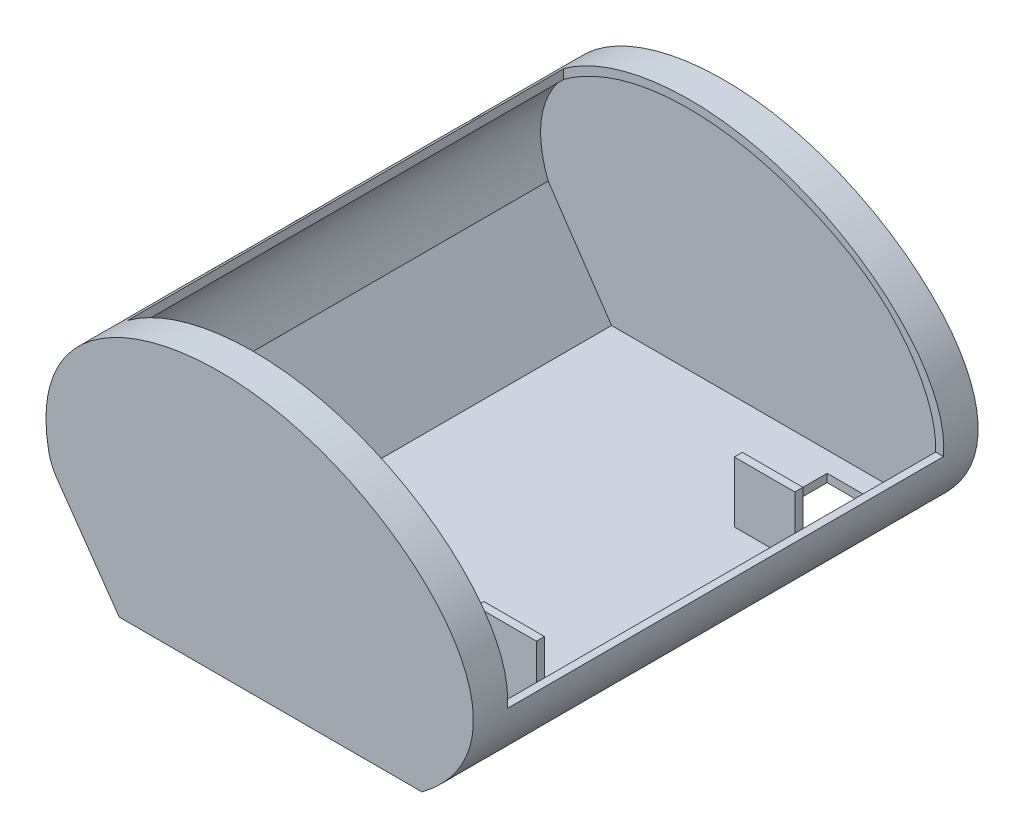
ISO-10303-21;
HEADER;
FILE_DESCRIPTION(('STEP AP214'),'2;1');
FILE_NAME('part.step','',(''),(''),'','','');
FILE_SCHEMA(('AUTOMOTIVE_DESIGN { 1 0 10303 214 1 1 1 1 }'));
ENDSEC;
DATA;
#1=APPLICATION_CONTEXT('core data for automotive mechanical design processes');
#2=APPLICATION_PROTOCOL_DEFINITION('international standard','automotive_design',2000,#1);
#3=PRODUCT_CONTEXT('',#1,'mechanical');
#4=PRODUCT('Part','Part','',(#3));
#5=PRODUCT_RELATED_PRODUCT_CATEGORY('part','',(#4));
#6=PRODUCT_DEFINITION_FORMATION('','',#4);
#7=PRODUCT_DEFINITION_CONTEXT('part definition',#1,'design');
#8=PRODUCT_DEFINITION('design','',#6,#7);
#9=PRODUCT_DEFINITION_SHAPE('','',#8);
#10=(LENGTH_UNIT() NAMED_UNIT(*) SI_UNIT(.MILLI.,.METRE.));
#11=(NAMED_UNIT(*) PLANE_ANGLE_UNIT() SI_UNIT($,.RADIAN.));
#12=(NAMED_UNIT(*) SI_UNIT($,.STERADIAN.) SOLID_ANGLE_UNIT());
#13=UNCERTAINTY_MEASURE_WITH_UNIT(LENGTH_MEASURE(1.E-05),#10,'distance_accuracy_value','');
#14=(GEOMETRIC_REPRESENTATION_CONTEXT(3) GLOBAL_UNCERTAINTY_ASSIGNED_CONTEXT((#13)) GLOBAL_UNIT_ASSIGNED_CONTEXT((#10,
#11,#12)) REPRESENTATION_CONTEXT('',''));
#15=CARTESIAN_POINT('',(0.,0.,0.));
#16=DIRECTION('',(0.,0.,1.));
#17=DIRECTION('',(1.,0.,0.));
#18=AXIS2_PLACEMENT_3D('',#15,#16,#17);
#19=CARTESIAN_POINT('',(-73.6035136631855,4.,6.99999999999998));
#20=DIRECTION('',(0.,-1.,0.));
#21=DIRECTION('',(0.,0.,-1.));
#22=AXIS2_PLACEMENT_3D('',#19,#20,#21);
#23=PLANE('',#22);
#24=DIRECTION('',(0.,0.,1.));
#25=VECTOR('',#24,1.);
#26=CARTESIAN_POINT('',(43.1633759469,4.,59.));
#27=LINE('',#26,#25);
#28=CARTESIAN_POINT('',(43.1633759469,4.,59.));
#29=VERTEX_POINT('',#28);
#30=CARTESIAN_POINT('',(43.1633759469,4.,63.));
#31=VERTEX_POINT('',#30);
#32=EDGE_CURVE('E263',#29,#31,#27,.T.);
#33=ORIENTED_EDGE('',*,*,#32,.F.);
#34=DIRECTION('',(0.,0.,-1.));
#35=VECTOR('',#34,1.);
#36=CARTESIAN_POINT('',(43.1633759469,4.,6.99999999999998));
#37=LINE('',#36,#35);
#38=CARTESIAN_POINT('',(43.1633759469,4.,17.));
#39=VERTEX_POINT('',#38);
#40=EDGE_CURVE('E245',#29,#39,#37,.T.);
#41=ORIENTED_EDGE('',*,*,#40,.T.);
#42=DIRECTION('',(1.,0.,0.));
#43=VECTOR('',#42,1.);
#44=CARTESIAN_POINT('',(-73.6035136631855,4.,17.));
#45=LINE('',#44,#43);
#46=CARTESIAN_POINT('',(73.1633759469,3.99999999999999,17.));
#47=VERTEX_POINT('',#46);
#48=EDGE_CURVE('E248',#39,#47,#45,.T.);
#49=ORIENTED_EDGE('',*,*,#48,.T.);
#50=DIRECTION('',(0.,0.,1.));
#51=VECTOR('',#50,1.);
#52=CARTESIAN_POINT('',(73.1633759469,4.,6.99999999999998));
#53=LINE('',#52,#51);
#54=CARTESIAN_POINT('',(73.1633759469,4.,6.99999999999998));
#55=VERTEX_POINT('',#54);
#56=EDGE_CURVE('E422',#55,#47,#53,.T.);
#57=ORIENTED_EDGE('',*,*,#56,.F.);
#58=DIRECTION('',(1.,0.,0.));
#59=VECTOR('',#58,1.);
#60=CARTESIAN_POINT('',(-73.6035136631855,4.,6.99999999999998));
#61=LINE('',#60,#59);
#62=CARTESIAN_POINT('',(-73.6035136631855,4.,6.99999999999998));
#63=VERTEX_POINT('',#62);
#64=EDGE_CURVE('E479',#63,#55,#61,.T.);
#65=ORIENTED_EDGE('',*,*,#64,.F.);
#66=DIRECTION('',(0.,0.,1.));
#67=VECTOR('',#66,1.);
#68=CARTESIAN_POINT('',(-73.6035136631855,4.,6.99999999999998));
#69=LINE('',#68,#67);
#70=CARTESIAN_POINT('',(-73.6035136631855,4.,243.));
#71=VERTEX_POINT('',#70);
#72=EDGE_CURVE('E481',#63,#71,#69,.T.);
#73=ORIENTED_EDGE('',*,*,#72,.T.);
#74=DIRECTION('',(1.,0.,0.));
#75=VECTOR('',#74,1.);
#76=CARTESIAN_POINT('',(-73.6035136631855,4.,243.));
#77=LINE('',#76,#75);
#78=CARTESIAN_POINT('',(73.1633759469,4.,243.));
#79=VERTEX_POINT('',#78);
#80=EDGE_CURVE('E367',#71,#79,#77,.T.);
#81=ORIENTED_EDGE('',*,*,#80,.T.);
#82=CARTESIAN_POINT('',(73.1633759469,4.,233.));
#83=VERTEX_POINT('',#82);
#84=EDGE_CURVE('E483',#83,#79,#53,.T.);
#85=ORIENTED_EDGE('',*,*,#84,.F.);
#86=DIRECTION('',(-1.,0.,0.));
#87=VECTOR('',#86,1.);
#88=CARTESIAN_POINT('',(-73.6035136631855,4.,233.));
#89=LINE('',#88,#87);
#90=CARTESIAN_POINT('',(43.1633759469,4.,233.));
#91=VERTEX_POINT('',#90);
#92=EDGE_CURVE('E299',#83,#91,#89,.T.);
#93=ORIENTED_EDGE('',*,*,#92,.T.);
#94=DIRECTION('',(0.,0.,-1.));
#95=VECTOR('',#94,1.);
#96=CARTESIAN_POINT('',(43.1633759469,4.,6.99999999999998));
#97=LINE('',#96,#95);
#98=CARTESIAN_POINT('',(43.1633759469,4.,191.));
#99=VERTEX_POINT('',#98);
#100=EDGE_CURVE('E290',#91,#99,#97,.T.);
#101=ORIENTED_EDGE('',*,*,#100,.T.);
#102=DIRECTION('',(0.,0.,1.));
#103=VECTOR('',#102,1.);
#104=CARTESIAN_POINT('',(43.1633759469,4.,187.));
#105=LINE('',#104,#103);
#106=CARTESIAN_POINT('',(43.1633759469,4.,187.));
#107=VERTEX_POINT('',#106);
#108=EDGE_CURVE('E307',#107,#99,#105,.T.);
#109=ORIENTED_EDGE('',*,*,#108,.F.);
#110=DIRECTION('',(-1.,0.,0.));
#111=VECTOR('',#110,1.);
#112=CARTESIAN_POINT('',(73.1633759469,4.,187.));
#113=LINE('',#112,#111);
#114=CARTESIAN_POINT('',(73.1633759469,4.,187.));
#115=VERTEX_POINT('',#114);
#116=EDGE_CURVE('E316',#115,#107,#113,.T.);
#117=ORIENTED_EDGE('',*,*,#116,.F.);
#118=CARTESIAN_POINT('',(73.1633759469,4.,63.));
#119=VERTEX_POINT('',#118);
#120=EDGE_CURVE('E486',#119,#115,#53,.T.);
#121=ORIENTED_EDGE('',*,*,#120,.F.);
#122=DIRECTION('',(1.,0.,0.));
#123=VECTOR('',#122,1.);
#124=CARTESIAN_POINT('',(43.1633759469,4.,63.));
#125=LINE('',#124,#123);
#126=EDGE_CURVE('E256',#31,#119,#125,.T.);
#127=ORIENTED_EDGE('',*,*,#126,.F.);
#128=EDGE_LOOP('',(#33,#41,#49,#57,#65,#73,#81,#85,#93,#101,#109,#117,#121,#127));
#129=FACE_BOUND('',#128,.T.);
#130=ADVANCED_FACE('F36',(#129),#23,.F.);
#131=CARTESIAN_POINT('',(75.533147288239,0.,250.));
#132=CARTESIAN_POINT('',(138.063372933709,47.200510512775,250.));
#133=CARTESIAN_POINT('',(16.4700015421519,172.007803307629,250.));
#134=CARTESIAN_POINT('',(-124.949591117591,111.301552399339,250.));
#135=CARTESIAN_POINT('',(-108.081203547603,48.0359610796154,250.));
#136=B_SPLINE_CURVE_WITH_KNOTS('',3,(#131,#132,#133,#134,#135),.UNSPECIFIED.,.F.,.F.,(4,1,4),
(0.,0.526874502564795,1.),.UNSPECIFIED.);
#137=DIRECTION('',(0.,0.,-1.));
#138=VECTOR('',#137,1.);
#139=SURFACE_OF_LINEAR_EXTRUSION('',#136,#138);
#140=CARTESIAN_POINT('',(75.533147288239,0.,0.));
#141=CARTESIAN_POINT('',(138.063372933709,47.200510512775,0.));
#142=CARTESIAN_POINT('',(16.4700015421519,172.007803307629,0.));
#143=CARTESIAN_POINT('',(-124.949591117591,111.301552399339,0.));
#144=CARTESIAN_POINT('',(-108.081203547603,48.0359610796154,0.));
#145=B_SPLINE_CURVE_WITH_KNOTS('',3,(#140,#141,#142,#143,#144),.UNSPECIFIED.,.F.,.F.,(4,1,4),
(0.,0.526874502564795,1.),.UNSPECIFIED.);
#146=CARTESIAN_POINT('',(75.533147288239,0.,0.));
#147=VERTEX_POINT('',#146);
#148=CARTESIAN_POINT('',(-109.377947898669,53.6487675030821,0.));
#149=VERTEX_POINT('',#148);
#150=EDGE_CURVE('E424',#147,#149,#145,.T.);
#151=ORIENTED_EDGE('',*,*,#150,.T.);
#152=DIRECTION('',(0.,0.,-1.));
#153=VECTOR('',#152,1.);
#154=CARTESIAN_POINT('',(-109.377947898669,53.6487675030821,0.));
#155=LINE('',#154,#153);
#156=CARTESIAN_POINT('',(-109.377947898669,53.6487675030821,250.));
#157=VERTEX_POINT('',#156);
#158=EDGE_CURVE('E44',#149,#157,#155,.F.);
#159=ORIENTED_EDGE('',*,*,#158,.T.);
#160=CARTESIAN_POINT('',(75.533147288239,0.,250.));
#161=VERTEX_POINT('',#160);
#162=EDGE_CURVE('E406',#161,#157,#136,.T.);
#163=ORIENTED_EDGE('',*,*,#162,.F.);
#164=DIRECTION('',(0.,0.,-1.));
#165=VECTOR('',#164,1.);
#166=CARTESIAN_POINT('',(75.533147288239,0.,250.));
#167=LINE('',#166,#165);
#168=EDGE_CURVE('E413',#161,#147,#167,.T.);
#169=ORIENTED_EDGE('',*,*,#168,.T.);
#170=EDGE_LOOP('',(#151,#159,#163,#169));
#171=FACE_BOUND('',#170,.T.);
#172=CARTESIAN_POINT('',(75.533147288239,0.,17.));
#173=CARTESIAN_POINT('',(138.063372933709,47.200510512775,17.));
#174=CARTESIAN_POINT('',(16.4700015421519,172.007803307629,17.));
#175=CARTESIAN_POINT('',(-124.949591117591,111.301552399339,17.));
#176=CARTESIAN_POINT('',(-108.081203547603,48.0359610796154,17.));
#177=B_SPLINE_CURVE_WITH_KNOTS('',3,(#172,#173,#174,#175,#176),.UNSPECIFIED.,.F.,.F.,(4,1,4),
(0.,0.526874502564795,1.),.UNSPECIFIED.);
#178=CARTESIAN_POINT('',(100.817760707179,40.,17.));
#179=VERTEX_POINT('',#178);
#180=CARTESIAN_POINT('',(-87.2929632459917,112.348527909877,17.));
#181=VERTEX_POINT('',#180);
#182=EDGE_CURVE('E355',#179,#181,#177,.T.);
#183=ORIENTED_EDGE('',*,*,#182,.F.);
#184=DIRECTION('',(0.,0.,-1.));
#185=VECTOR('',#184,1.);
#186=CARTESIAN_POINT('',(100.817760707179,40.,250.));
#187=LINE('',#186,#185);
#188=CARTESIAN_POINT('',(100.817760707179,40.,233.));
#189=VERTEX_POINT('',#188);
#190=EDGE_CURVE('E344',#189,#179,#187,.T.);
#191=ORIENTED_EDGE('',*,*,#190,.F.);
#192=CARTESIAN_POINT('',(75.533147288239,0.,233.));
#193=CARTESIAN_POINT('',(138.063372933709,47.200510512775,233.));
#194=CARTESIAN_POINT('',(16.4700015421519,172.007803307629,233.));
#195=CARTESIAN_POINT('',(-124.949591117591,111.301552399339,233.));
#196=CARTESIAN_POINT('',(-108.081203547603,48.0359610796154,233.));
#197=B_SPLINE_CURVE_WITH_KNOTS('',3,(#192,#193,#194,#195,#196),.UNSPECIFIED.,.F.,.F.,(4,1,4),
(0.,0.526874502564795,1.),.UNSPECIFIED.);
#198=CARTESIAN_POINT('',(-87.2929632459916,112.348527917054,233.));
#199=VERTEX_POINT('',#198);
#200=EDGE_CURVE('E346',#199,#189,#197,.F.);
#201=ORIENTED_EDGE('',*,*,#200,.F.);
#202=DIRECTION('',(0.,0.,-1.));
#203=VECTOR('',#202,1.);
#204=CARTESIAN_POINT('',(-87.2929632459916,112.348527909877,250.));
#205=LINE('',#204,#203);
#206=EDGE_CURVE('E350',#181,#199,#205,.F.);
#207=ORIENTED_EDGE('',*,*,#206,.F.);
#208=EDGE_LOOP('',(#183,#191,#201,#207));
#209=FACE_BOUND('',#208,.T.);
#210=ADVANCED_FACE('F400',(#171,#209),#139,.F.);
#211=CARTESIAN_POINT('',(-108.081203547603,48.0359610796154,250.));
#212=DIRECTION('',(0.819318627790458,0.573338456895716,0.));
#213=DIRECTION('',(-0.573338456895716,0.819318627790458,0.));
#214=AXIS2_PLACEMENT_3D('',#211,#212,#213);
#215=PLANE('',#214);
#216=DIRECTION('',(0.573338456895716,-0.819318627790458,0.));
#217=VECTOR('',#216,1.);
#218=CARTESIAN_POINT('',(-108.081203547603,48.0359610796154,250.));
#219=LINE('',#218,#217);
#220=CARTESIAN_POINT('',(-105.3215590263,44.09234254995,250.));
#221=VERTEX_POINT('',#220);
#222=CARTESIAN_POINT('',(-74.466852711761,0.,250.));
#223=VERTEX_POINT('',#222);
#224=EDGE_CURVE('E429',#221,#223,#219,.T.);
#225=ORIENTED_EDGE('',*,*,#224,.F.);
#226=DIRECTION('',(0.,0.,-1.));
#227=VECTOR('',#226,1.);
#228=CARTESIAN_POINT('',(-105.3215590263,44.09234254995,250.));
#229=LINE('',#228,#227);
#230=CARTESIAN_POINT('',(-105.3215590263,44.09234254995,0.));
#231=VERTEX_POINT('',#230);
#232=EDGE_CURVE('E453',#221,#231,#229,.T.);
#233=ORIENTED_EDGE('',*,*,#232,.T.);
#234=DIRECTION('',(0.573338456895716,-0.819318627790458,0.));
#235=VECTOR('',#234,1.);
#236=CARTESIAN_POINT('',(-108.081203547603,48.0359610796154,0.));
#237=LINE('',#236,#235);
#238=CARTESIAN_POINT('',(-74.466852711761,0.,0.));
#239=VERTEX_POINT('',#238);
#240=EDGE_CURVE('E416',#231,#239,#237,.T.);
#241=ORIENTED_EDGE('',*,*,#240,.T.);
#242=DIRECTION('',(0.,0.,-1.));
#243=VECTOR('',#242,1.);
#244=CARTESIAN_POINT('',(-74.466852711761,0.,250.));
#245=LINE('',#244,#243);
#246=EDGE_CURVE('E435',#223,#239,#245,.T.);
#247=ORIENTED_EDGE('',*,*,#246,.F.);
#248=EDGE_LOOP('',(#225,#233,#241,#247));
#249=FACE_BOUND('',#248,.T.);
#250=ADVANCED_FACE('F404',(#249),#215,.F.);
#251=CARTESIAN_POINT('',(-74.466852711761,0.,250.));
#252=DIRECTION('',(0.,1.,0.));
#253=DIRECTION('',(0.,0.,1.));
#254=AXIS2_PLACEMENT_3D('',#251,#252,#253);
#255=PLANE('',#254);
#256=DIRECTION('',(0.,0.,1.));
#257=VECTOR('',#256,1.);
#258=CARTESIAN_POINT('',(43.1633759469,0.,59.));
#259=LINE('',#258,#257);
#260=CARTESIAN_POINT('',(43.1633759469,0.,17.));
#261=VERTEX_POINT('',#260);
#262=CARTESIAN_POINT('',(43.1633759469,0.,59.));
#263=VERTEX_POINT('',#262);
#264=EDGE_CURVE('E223',#261,#263,#259,.T.);
#265=ORIENTED_EDGE('',*,*,#264,.T.);
#266=DIRECTION('',(1.,0.,0.));
#267=VECTOR('',#266,1.);
#268=CARTESIAN_POINT('',(73.1633759469,0.,59.));
#269=LINE('',#268,#267);
#270=CARTESIAN_POINT('',(73.1633759469,0.,59.));
#271=VERTEX_POINT('',#270);
#272=EDGE_CURVE('E216',#263,#271,#269,.T.);
#273=ORIENTED_EDGE('',*,*,#272,.T.);
#274=DIRECTION('',(0.,0.,-1.));
#275=VECTOR('',#274,1.);
#276=CARTESIAN_POINT('',(73.1633759469,0.,17.));
#277=LINE('',#276,#275);
#278=CARTESIAN_POINT('',(73.1633759469,0.,17.));
#279=VERTEX_POINT('',#278);
#280=EDGE_CURVE('E226',#271,#279,#277,.T.);
#281=ORIENTED_EDGE('',*,*,#280,.T.);
#282=DIRECTION('',(-1.,0.,0.));
#283=VECTOR('',#282,1.);
#284=CARTESIAN_POINT('',(43.1633759469,0.,17.));
#285=LINE('',#284,#283);
#286=EDGE_CURVE('E51',#279,#261,#285,.T.);
#287=ORIENTED_EDGE('',*,*,#286,.T.);
#288=EDGE_LOOP('',(#265,#273,#281,#287));
#289=FACE_BOUND('',#288,.T.);
#290=DIRECTION('',(0.,0.,-1.));
#291=VECTOR('',#290,1.);
#292=CARTESIAN_POINT('',(73.1633759469,0.,191.));
#293=LINE('',#292,#291);
#294=CARTESIAN_POINT('',(73.1633759469,0.,233.));
#295=VERTEX_POINT('',#294);
#296=CARTESIAN_POINT('',(73.1633759469,0.,191.));
#297=VERTEX_POINT('',#296);
#298=EDGE_CURVE('E283',#295,#297,#293,.T.);
#299=ORIENTED_EDGE('',*,*,#298,.T.);
#300=DIRECTION('',(-1.,0.,0.));
#301=VECTOR('',#300,1.);
#302=CARTESIAN_POINT('',(43.1633759469,0.,191.));
#303=LINE('',#302,#301);
#304=CARTESIAN_POINT('',(43.1633759469,0.,191.));
#305=VERTEX_POINT('',#304);
#306=EDGE_CURVE('E274',#297,#305,#303,.T.);
#307=ORIENTED_EDGE('',*,*,#306,.T.);
#308=DIRECTION('',(0.,0.,1.));
#309=VECTOR('',#308,1.);
#310=CARTESIAN_POINT('',(43.1633759469,0.,233.));
#311=LINE('',#310,#309);
#312=CARTESIAN_POINT('',(43.1633759469,0.,233.));
#313=VERTEX_POINT('',#312);
#314=EDGE_CURVE('E277',#305,#313,#311,.T.);
#315=ORIENTED_EDGE('',*,*,#314,.T.);
#316=DIRECTION('',(1.,0.,0.));
#317=VECTOR('',#316,1.);
#318=CARTESIAN_POINT('',(73.1633759469,0.,233.));
#319=LINE('',#318,#317);
#320=EDGE_CURVE('E280',#313,#295,#319,.T.);
#321=ORIENTED_EDGE('',*,*,#320,.T.);
#322=EDGE_LOOP('',(#299,#307,#315,#321));
#323=FACE_BOUND('',#322,.T.);
#324=DIRECTION('',(1.,0.,0.));
#325=VECTOR('',#324,1.);
#326=CARTESIAN_POINT('',(-74.466852711761,0.,0.));
#327=LINE('',#326,#325);
#328=EDGE_CURVE('E421',#239,#147,#327,.T.);
#329=ORIENTED_EDGE('',*,*,#328,.T.);
#330=ORIENTED_EDGE('',*,*,#168,.F.);
#331=DIRECTION('',(1.,0.,0.));
#332=VECTOR('',#331,1.);
#333=CARTESIAN_POINT('',(-74.466852711761,0.,250.));
#334=LINE('',#333,#332);
#335=EDGE_CURVE('E414',#223,#161,#334,.T.);
#336=ORIENTED_EDGE('',*,*,#335,.F.);
#337=ORIENTED_EDGE('',*,*,#246,.T.);
#338=EDGE_LOOP('',(#329,#330,#336,#337));
#339=FACE_BOUND('',#338,.T.);
#340=ADVANCED_FACE('F230',(#289,#323,#339),#255,.F.);
#341=CARTESIAN_POINT('',(15.0172284058632,124.643387424618,250.));
#342=DIRECTION('',(0.,0.,-1.));
#343=DIRECTION('',(-1.,0.,0.));
#344=AXIS2_PLACEMENT_3D('',#341,#342,#343);
#345=PLANE('',#344);
#346=ORIENTED_EDGE('',*,*,#162,.T.);
#347=CARTESIAN_POINT('',(-84.8385933315385,58.4258039723429,250.));
#348=DIRECTION('',(0.,0.,-1.));
#349=DIRECTION('',(-1.,0.,0.));
#350=AXIS2_PLACEMENT_3D('',#347,#348,#349);
#351=CIRCLE('',#350,25.);
#352=EDGE_CURVE('E11',#157,#221,#351,.F.);
#353=ORIENTED_EDGE('',*,*,#352,.T.);
#354=ORIENTED_EDGE('',*,*,#224,.T.);
#355=ORIENTED_EDGE('',*,*,#335,.T.);
#356=EDGE_LOOP('',(#346,#353,#354,#355));
#357=FACE_BOUND('',#356,.T.);
#358=ADVANCED_FACE('F391',(#357),#345,.F.);
#359=CARTESIAN_POINT('',(15.0172284058632,124.643387424618,0.));
#360=DIRECTION('',(0.,0.,-1.));
#361=DIRECTION('',(-1.,0.,0.));
#362=AXIS2_PLACEMENT_3D('',#359,#360,#361);
#363=PLANE('',#362);
#364=ORIENTED_EDGE('',*,*,#240,.F.);
#365=CARTESIAN_POINT('',(-84.8385933315385,58.4258039723429,0.));
#366=DIRECTION('',(0.,0.,-1.));
#367=DIRECTION('',(-1.,0.,0.));
#368=AXIS2_PLACEMENT_3D('',#365,#366,#367);
#369=CIRCLE('',#368,25.);
#370=EDGE_CURVE('E459',#231,#149,#369,.T.);
#371=ORIENTED_EDGE('',*,*,#370,.T.);
#372=ORIENTED_EDGE('',*,*,#150,.F.);
#373=ORIENTED_EDGE('',*,*,#328,.F.);
#374=EDGE_LOOP('',(#364,#371,#372,#373));
#375=FACE_BOUND('',#374,.T.);
#376=ADVANCED_FACE('F394',(#375),#363,.T.);
#377=CARTESIAN_POINT('',(100.952032286488,276.,17.));
#378=DIRECTION('',(0.,0.,1.));
#379=DIRECTION('',(1.,0.,0.));
#380=AXIS2_PLACEMENT_3D('',#377,#378,#379);
#381=PLANE('',#380);
#382=ORIENTED_EDGE('',*,*,#182,.T.);
#383=DIRECTION('',(0.,-1.,0.));
#384=VECTOR('',#383,1.);
#385=CARTESIAN_POINT('',(-87.2929632459917,276.,17.));
#386=LINE('',#385,#384);
#387=CARTESIAN_POINT('',(-87.2929632459917,107.728967573858,17.));
#388=VERTEX_POINT('',#387);
#389=EDGE_CURVE('E341',#181,#388,#386,.T.);
#390=ORIENTED_EDGE('',*,*,#389,.T.);
#391=CARTESIAN_POINT('',(80.7933445131643,10.7283548595188,17.));
#392=CARTESIAN_POINT('',(92.6518174180523,19.5638089018508,17.));
#393=CARTESIAN_POINT('',(103.009839438884,45.2055581146663,17.));
#394=CARTESIAN_POINT('',(79.9540275925971,88.9181032500631,17.));
#395=CARTESIAN_POINT('',(40.6078998734824,112.956105179898,17.));
#396=CARTESIAN_POINT('',(-11.2047524715402,129.142722191542,17.));
#397=CARTESIAN_POINT('',(-79.4316828248308,124.667635826406,17.));
#398=CARTESIAN_POINT('',(-117.344714605008,82.323825457182,17.));
#399=CARTESIAN_POINT('',(-105.002588912021,50.2782470025866,17.));
#400=B_SPLINE_CURVE_WITH_KNOTS('',3,(#391,#392,#393,#394,#395,#396,#397,#398,#399),
.UNSPECIFIED.,.F.,.F.,(4,1,1,1,1,1,4),(0.0162788731190725,0.12675304049054,0.268313114127122,
0.41474667415268,0.542882575717674,0.761532881303762,1.),.UNSPECIFIED.);
#401=CARTESIAN_POINT('',(96.9220854235917,40.,17.));
#402=VERTEX_POINT('',#401);
#403=EDGE_CURVE('E449',#388,#402,#400,.F.);
#404=ORIENTED_EDGE('',*,*,#403,.T.);
#405=DIRECTION('',(-1.,0.,0.));
#406=VECTOR('',#405,1.);
#407=CARTESIAN_POINT('',(100.952032286488,40.,17.));
#408=LINE('',#407,#406);
#409=EDGE_CURVE('E332',#179,#402,#408,.T.);
#410=ORIENTED_EDGE('',*,*,#409,.F.);
#411=EDGE_LOOP('',(#382,#390,#404,#410));
#412=FACE_BOUND('',#411,.T.);
#413=ADVANCED_FACE('F398',(#412),#381,.T.);
#414=CARTESIAN_POINT('',(-87.2929632459917,276.,17.));
#415=DIRECTION('',(1.,0.,0.));
#416=DIRECTION('',(0.,0.,-1.));
#417=AXIS2_PLACEMENT_3D('',#414,#415,#416);
#418=PLANE('',#417);
#419=ORIENTED_EDGE('',*,*,#206,.T.);
#420=DIRECTION('',(0.,-1.,0.));
#421=VECTOR('',#420,1.);
#422=CARTESIAN_POINT('',(-87.2929632459916,276.,233.));
#423=LINE('',#422,#421);
#424=CARTESIAN_POINT('',(-87.2929632459916,107.728967581088,233.));
#425=VERTEX_POINT('',#424);
#426=EDGE_CURVE('E338',#199,#425,#423,.T.);
#427=ORIENTED_EDGE('',*,*,#426,.T.);
#428=DIRECTION('',(0.,0.,1.));
#429=VECTOR('',#428,1.);
#430=CARTESIAN_POINT('',(-87.2929632459917,107.728967573857,6.99999999999998));
#431=LINE('',#430,#429);
#432=EDGE_CURVE('E444',#425,#388,#431,.F.);
#433=ORIENTED_EDGE('',*,*,#432,.T.);
#434=ORIENTED_EDGE('',*,*,#389,.F.);
#435=EDGE_LOOP('',(#419,#427,#433,#434));
#436=FACE_BOUND('',#435,.T.);
#437=ADVANCED_FACE('F575',(#436),#418,.T.);
#438=CARTESIAN_POINT('',(-87.2929632459916,276.,233.));
#439=DIRECTION('',(0.,0.,-1.));
#440=DIRECTION('',(-1.,0.,0.));
#441=AXIS2_PLACEMENT_3D('',#438,#439,#440);
#442=PLANE('',#441);
#443=ORIENTED_EDGE('',*,*,#200,.T.);
#444=DIRECTION('',(1.,0.,0.));
#445=VECTOR('',#444,1.);
#446=CARTESIAN_POINT('',(-87.2929632459916,40.,233.));
#447=LINE('',#446,#445);
#448=CARTESIAN_POINT('',(96.9220854235917,40.,233.));
#449=VERTEX_POINT('',#448);
#450=EDGE_CURVE('E335',#449,#189,#447,.T.);
#451=ORIENTED_EDGE('',*,*,#450,.F.);
#452=CARTESIAN_POINT('',(80.7933445131643,10.7283548595188,233.));
#453=CARTESIAN_POINT('',(92.6518174180523,19.5638089018508,233.));
#454=CARTESIAN_POINT('',(103.009839438884,45.2055581146663,233.));
#455=CARTESIAN_POINT('',(79.9540275925971,88.9181032500631,233.));
#456=CARTESIAN_POINT('',(40.6078998734824,112.956105179898,233.));
#457=CARTESIAN_POINT('',(-11.2047524715402,129.142722191542,233.));
#458=CARTESIAN_POINT('',(-79.4316828248308,124.667635826406,233.));
#459=CARTESIAN_POINT('',(-117.344714605008,82.323825457182,233.));
#460=CARTESIAN_POINT('',(-105.002588912021,50.2782470025866,233.));
#461=B_SPLINE_CURVE_WITH_KNOTS('',3,(#452,#453,#454,#455,#456,#457,#458,#459,#460),
.UNSPECIFIED.,.F.,.F.,(4,1,1,1,1,1,4),(0.0162788731190725,0.12675304049054,0.268313114127122,
0.41474667415268,0.542882575717674,0.761532881303762,1.),.UNSPECIFIED.);
#462=EDGE_CURVE('E440',#449,#425,#461,.T.);
#463=ORIENTED_EDGE('',*,*,#462,.T.);
#464=ORIENTED_EDGE('',*,*,#426,.F.);
#465=EDGE_LOOP('',(#443,#451,#463,#464));
#466=FACE_BOUND('',#465,.T.);
#467=ADVANCED_FACE('F579',(#466),#442,.T.);
#468=CARTESIAN_POINT('',(0.,40.,0.));
#469=DIRECTION('',(0.,1.,0.));
#470=DIRECTION('',(0.,0.,1.));
#471=AXIS2_PLACEMENT_3D('',#468,#469,#470);
#472=PLANE('',#471);
#473=ORIENTED_EDGE('',*,*,#190,.T.);
#474=ORIENTED_EDGE('',*,*,#409,.T.);
#475=DIRECTION('',(0.,0.,1.));
#476=VECTOR('',#475,1.);
#477=CARTESIAN_POINT('',(96.9220854235917,40.,6.99999999999998));
#478=LINE('',#477,#476);
#479=EDGE_CURVE('E438',#402,#449,#478,.T.);
#480=ORIENTED_EDGE('',*,*,#479,.T.);
#481=ORIENTED_EDGE('',*,*,#450,.T.);
#482=EDGE_LOOP('',(#473,#474,#480,#481));
#483=FACE_BOUND('',#482,.T.);
#484=ADVANCED_FACE('F384',(#483),#472,.T.);
#485=CARTESIAN_POINT('',(80.7933445131643,10.7283548595188,6.99999999999998));
#486=CARTESIAN_POINT('',(92.6518174180523,19.5638089018508,6.99999999999998));
#487=CARTESIAN_POINT('',(103.009839438884,45.2055581146663,6.99999999999998));
#488=CARTESIAN_POINT('',(79.9540275925971,88.9181032500631,6.99999999999998));
#489=CARTESIAN_POINT('',(40.6078998734824,112.956105179898,6.99999999999998));
#490=CARTESIAN_POINT('',(-11.2047524715402,129.142722191542,6.99999999999998));
#491=CARTESIAN_POINT('',(-79.4316828248308,124.667635826406,6.99999999999998));
#492=CARTESIAN_POINT('',(-117.344714605008,82.323825457182,6.99999999999998));
#493=CARTESIAN_POINT('',(-105.002588912021,50.2782470025866,6.99999999999998));
#494=B_SPLINE_CURVE_WITH_KNOTS('',3,(#485,#486,#487,#488,#489,#490,#491,#492,#493),
.UNSPECIFIED.,.F.,.F.,(4,1,1,1,1,1,4),(0.0162788731190725,0.12675304049054,0.268313114127122,
0.41474667415268,0.542882575717674,0.761532881303762,1.),.UNSPECIFIED.);
#495=DIRECTION('',(0.,0.,1.));
#496=VECTOR('',#495,1.);
#497=SURFACE_OF_LINEAR_EXTRUSION('',#494,#496);
#498=CARTESIAN_POINT('',(80.7933445131643,10.7283548595188,243.));
#499=CARTESIAN_POINT('',(92.6518174180523,19.5638089018508,243.));
#500=CARTESIAN_POINT('',(103.009839438884,45.2055581146663,243.));
#501=CARTESIAN_POINT('',(79.9540275925971,88.9181032500631,243.));
#502=CARTESIAN_POINT('',(40.6078998734824,112.956105179898,243.));
#503=CARTESIAN_POINT('',(-11.2047524715402,129.142722191542,243.));
#504=CARTESIAN_POINT('',(-79.4316828248308,124.667635826406,243.));
#505=CARTESIAN_POINT('',(-117.344714605008,82.323825457182,243.));
#506=CARTESIAN_POINT('',(-105.002588912021,50.2782470025866,243.));
#507=B_SPLINE_CURVE_WITH_KNOTS('',3,(#498,#499,#500,#501,#502,#503,#504,#505,#506),
.UNSPECIFIED.,.F.,.F.,(4,1,1,1,1,1,4),(0.0162788731190725,0.12675304049054,0.268313114127122,
0.41474667415268,0.542882575717674,0.761532881303762,1.),.UNSPECIFIED.);
#508=CARTESIAN_POINT('',(80.7933445131643,10.7283548595188,243.));
#509=VERTEX_POINT('',#508);
#510=CARTESIAN_POINT('',(-105.002588912021,50.2782470025866,243.));
#511=VERTEX_POINT('',#510);
#512=EDGE_CURVE('E493',#509,#511,#507,.T.);
#513=ORIENTED_EDGE('',*,*,#512,.T.);
#514=DIRECTION('',(0.,0.,1.));
#515=VECTOR('',#514,1.);
#516=CARTESIAN_POINT('',(-105.002588912021,50.2782470025866,6.99999999999998));
#517=LINE('',#516,#515);
#518=CARTESIAN_POINT('',(-105.002588912021,50.2782470025866,6.99999999999998));
#519=VERTEX_POINT('',#518);
#520=EDGE_CURVE('E478',#519,#511,#517,.T.);
#521=ORIENTED_EDGE('',*,*,#520,.F.);
#522=CARTESIAN_POINT('',(80.7933445131643,10.7283548595188,6.99999999999998));
#523=VERTEX_POINT('',#522);
#524=EDGE_CURVE('E366',#523,#519,#494,.T.);
#525=ORIENTED_EDGE('',*,*,#524,.F.);
#526=DIRECTION('',(0.,0.,1.));
#527=VECTOR('',#526,1.);
#528=CARTESIAN_POINT('',(80.7933445131643,10.7283548595188,6.99999999999998));
#529=LINE('',#528,#527);
#530=EDGE_CURVE('E476',#523,#509,#529,.T.);
#531=ORIENTED_EDGE('',*,*,#530,.T.);
#532=EDGE_LOOP('',(#513,#521,#525,#531));
#533=FACE_BOUND('',#532,.T.);
#534=ORIENTED_EDGE('',*,*,#403,.F.);
#535=ORIENTED_EDGE('',*,*,#432,.F.);
#536=ORIENTED_EDGE('',*,*,#462,.F.);
#537=ORIENTED_EDGE('',*,*,#479,.F.);
#538=EDGE_LOOP('',(#534,#535,#536,#537));
#539=FACE_BOUND('',#538,.T.);
#540=ADVANCED_FACE('F379',(#533,#539),#497,.F.);
#541=CARTESIAN_POINT('',(73.1633759469,4.,6.99999999999998));
#542=DIRECTION('',(0.661402166727986,-0.750031448572341,0.));
#543=DIRECTION('',(0.750031448572341,0.661402166727987,0.));
#544=AXIS2_PLACEMENT_3D('',#541,#542,#543);
#545=PLANE('',#544);
#546=DIRECTION('',(0.750031448572341,0.661402166727987,0.));
#547=VECTOR('',#546,1.);
#548=CARTESIAN_POINT('',(73.1633759469,4.,243.));
#549=LINE('',#548,#547);
#550=EDGE_CURVE('E359',#79,#509,#549,.T.);
#551=ORIENTED_EDGE('',*,*,#550,.T.);
#552=ORIENTED_EDGE('',*,*,#530,.F.);
#553=DIRECTION('',(0.750031448572341,0.661402166727987,0.));
#554=VECTOR('',#553,1.);
#555=CARTESIAN_POINT('',(73.1633759469,4.,6.99999999999998));
#556=LINE('',#555,#554);
#557=EDGE_CURVE('E360',#55,#523,#556,.T.);
#558=ORIENTED_EDGE('',*,*,#557,.F.);
#559=ORIENTED_EDGE('',*,*,#56,.T.);
#560=DIRECTION('',(0.,0.,1.));
#561=VECTOR('',#560,1.);
#562=CARTESIAN_POINT('',(73.1633759469,4.,6.99999999999998));
#563=LINE('',#562,#561);
#564=CARTESIAN_POINT('',(73.1633759469,4.,59.));
#565=VERTEX_POINT('',#564);
#566=EDGE_CURVE('E239',#47,#565,#563,.T.);
#567=ORIENTED_EDGE('',*,*,#566,.T.);
#568=DIRECTION('',(0.,0.,-1.));
#569=VECTOR('',#568,1.);
#570=CARTESIAN_POINT('',(73.1633759469,4.,63.));
#571=LINE('',#570,#569);
#572=EDGE_CURVE('E251',#119,#565,#571,.T.);
#573=ORIENTED_EDGE('',*,*,#572,.F.);
#574=ORIENTED_EDGE('',*,*,#120,.T.);
#575=DIRECTION('',(0.,0.,-1.));
#576=VECTOR('',#575,1.);
#577=CARTESIAN_POINT('',(73.1633759469,4.,191.));
#578=LINE('',#577,#576);
#579=CARTESIAN_POINT('',(73.1633759469,4.,191.));
#580=VERTEX_POINT('',#579);
#581=EDGE_CURVE('E302',#580,#115,#578,.T.);
#582=ORIENTED_EDGE('',*,*,#581,.F.);
#583=EDGE_CURVE('E487',#580,#83,#53,.T.);
#584=ORIENTED_EDGE('',*,*,#583,.T.);
#585=ORIENTED_EDGE('',*,*,#84,.T.);
#586=EDGE_LOOP('',(#551,#552,#558,#559,#567,#573,#574,#582,#584,#585));
#587=FACE_BOUND('',#586,.T.);
#588=ADVANCED_FACE('F383',(#587),#545,.F.);
#589=CARTESIAN_POINT('',(-105.002588912021,50.2782470025866,6.99999999999998));
#590=DIRECTION('',(-0.827509179255177,-0.561452186965571,0.));
#591=DIRECTION('',(0.561452186965571,-0.827509179255178,0.));
#592=AXIS2_PLACEMENT_3D('',#589,#590,#591);
#593=PLANE('',#592);
#594=DIRECTION('',(0.561452186965571,-0.827509179255177,0.));
#595=VECTOR('',#594,1.);
#596=CARTESIAN_POINT('',(-105.002588912021,50.2782470025866,243.));
#597=LINE('',#596,#595);
#598=EDGE_CURVE('E490',#511,#71,#597,.T.);
#599=ORIENTED_EDGE('',*,*,#598,.T.);
#600=ORIENTED_EDGE('',*,*,#72,.F.);
#601=DIRECTION('',(0.561452186965571,-0.827509179255177,0.));
#602=VECTOR('',#601,1.);
#603=CARTESIAN_POINT('',(-105.002588912021,50.2782470025866,6.99999999999998));
#604=LINE('',#603,#602);
#605=EDGE_CURVE('E373',#519,#63,#604,.T.);
#606=ORIENTED_EDGE('',*,*,#605,.F.);
#607=ORIENTED_EDGE('',*,*,#520,.T.);
#608=EDGE_LOOP('',(#599,#600,#606,#607));
#609=FACE_BOUND('',#608,.T.);
#610=ADVANCED_FACE('F386',(#609),#593,.F.);
#611=CARTESIAN_POINT('',(9.02922967914925,121.980036436193,6.99999999999998));
#612=DIRECTION('',(0.,0.,-1.));
#613=DIRECTION('',(-1.,0.,0.));
#614=AXIS2_PLACEMENT_3D('',#611,#612,#613);
#615=PLANE('',#614);
#616=ORIENTED_EDGE('',*,*,#557,.T.);
#617=ORIENTED_EDGE('',*,*,#524,.T.);
#618=ORIENTED_EDGE('',*,*,#605,.T.);
#619=ORIENTED_EDGE('',*,*,#64,.T.);
#620=EDGE_LOOP('',(#616,#617,#618,#619));
#621=FACE_BOUND('',#620,.T.);
#622=ADVANCED_FACE('F507',(#621),#615,.F.);
#623=CARTESIAN_POINT('',(9.02922967914925,121.980036436193,243.));
#624=DIRECTION('',(0.,0.,-1.));
#625=DIRECTION('',(-1.,0.,0.));
#626=AXIS2_PLACEMENT_3D('',#623,#624,#625);
#627=PLANE('',#626);
#628=ORIENTED_EDGE('',*,*,#550,.F.);
#629=ORIENTED_EDGE('',*,*,#80,.F.);
#630=ORIENTED_EDGE('',*,*,#598,.F.);
#631=ORIENTED_EDGE('',*,*,#512,.F.);
#632=EDGE_LOOP('',(#628,#629,#630,#631));
#633=FACE_BOUND('',#632,.T.);
#634=ADVANCED_FACE('F519',(#633),#627,.T.);
#635=CARTESIAN_POINT('',(-84.8385933315385,58.4258039723429,125.));
#636=DIRECTION('',(0.,0.,-1.));
#637=DIRECTION('',(-1.,0.,0.));
#638=AXIS2_PLACEMENT_3D('',#635,#636,#637);
#639=CYLINDRICAL_SURFACE('',#638,25.);
#640=ORIENTED_EDGE('',*,*,#352,.F.);
#641=ORIENTED_EDGE('',*,*,#158,.F.);
#642=ORIENTED_EDGE('',*,*,#370,.F.);
#643=ORIENTED_EDGE('',*,*,#232,.F.);
#644=EDGE_LOOP('',(#640,#641,#642,#643));
#645=FACE_BOUND('',#644,.T.);
#646=ADVANCED_FACE('F38',(#645),#639,.T.);
#647=CARTESIAN_POINT('',(73.1633759469,34.,191.));
#648=DIRECTION('',(-1.,0.,0.));
#649=DIRECTION('',(0.,0.,1.));
#650=AXIS2_PLACEMENT_3D('',#647,#648,#649);
#651=PLANE('',#650);
#652=ORIENTED_EDGE('',*,*,#581,.T.);
#653=DIRECTION('',(0.,-1.,0.));
#654=VECTOR('',#653,1.);
#655=CARTESIAN_POINT('',(73.1633759469,34.,187.));
#656=LINE('',#655,#654);
#657=CARTESIAN_POINT('',(73.1633759469,34.,187.));
#658=VERTEX_POINT('',#657);
#659=EDGE_CURVE('E329',#658,#115,#656,.T.);
#660=ORIENTED_EDGE('',*,*,#659,.F.);
#661=DIRECTION('',(0.,0.,-1.));
#662=VECTOR('',#661,1.);
#663=CARTESIAN_POINT('',(73.1633759469,34.,191.));
#664=LINE('',#663,#662);
#665=CARTESIAN_POINT('',(73.1633759469,34.,191.));
#666=VERTEX_POINT('',#665);
#667=EDGE_CURVE('E303',#666,#658,#664,.T.);
#668=ORIENTED_EDGE('',*,*,#667,.F.);
#669=DIRECTION('',(0.,-1.,0.));
#670=VECTOR('',#669,1.);
#671=CARTESIAN_POINT('',(73.1633759469,34.,191.));
#672=LINE('',#671,#670);
#673=EDGE_CURVE('E313',#666,#580,#672,.T.);
#674=ORIENTED_EDGE('',*,*,#673,.T.);
#675=EDGE_LOOP('',(#652,#660,#668,#674));
#676=FACE_BOUND('',#675,.T.);
#677=ADVANCED_FACE('F535',(#676),#651,.F.);
#678=CARTESIAN_POINT('',(73.1633759469,34.,187.));
#679=DIRECTION('',(0.,0.,1.));
#680=DIRECTION('',(1.,0.,0.));
#681=AXIS2_PLACEMENT_3D('',#678,#679,#680);
#682=PLANE('',#681);
#683=ORIENTED_EDGE('',*,*,#116,.T.);
#684=DIRECTION('',(0.,-1.,0.));
#685=VECTOR('',#684,1.);
#686=CARTESIAN_POINT('',(43.1633759469,34.,187.));
#687=LINE('',#686,#685);
#688=CARTESIAN_POINT('',(43.1633759469,34.,187.));
#689=VERTEX_POINT('',#688);
#690=EDGE_CURVE('E326',#689,#107,#687,.T.);
#691=ORIENTED_EDGE('',*,*,#690,.F.);
#692=DIRECTION('',(-1.,0.,0.));
#693=VECTOR('',#692,1.);
#694=CARTESIAN_POINT('',(73.1633759469,34.,187.));
#695=LINE('',#694,#693);
#696=EDGE_CURVE('E306',#658,#689,#695,.T.);
#697=ORIENTED_EDGE('',*,*,#696,.F.);
#698=ORIENTED_EDGE('',*,*,#659,.T.);
#699=EDGE_LOOP('',(#683,#691,#697,#698));
#700=FACE_BOUND('',#699,.T.);
#701=ADVANCED_FACE('F532',(#700),#682,.F.);
#702=CARTESIAN_POINT('',(43.1633759469,34.,187.));
#703=DIRECTION('',(1.,0.,0.));
#704=DIRECTION('',(0.,0.,-1.));
#705=AXIS2_PLACEMENT_3D('',#702,#703,#704);
#706=PLANE('',#705);
#707=ORIENTED_EDGE('',*,*,#108,.T.);
#708=DIRECTION('',(0.,-1.,0.));
#709=VECTOR('',#708,1.);
#710=CARTESIAN_POINT('',(43.1633759469,34.,191.));
#711=LINE('',#710,#709);
#712=CARTESIAN_POINT('',(43.1633759469,34.,191.));
#713=VERTEX_POINT('',#712);
#714=EDGE_CURVE('E323',#713,#99,#711,.T.);
#715=ORIENTED_EDGE('',*,*,#714,.F.);
#716=DIRECTION('',(0.,0.,1.));
#717=VECTOR('',#716,1.);
#718=CARTESIAN_POINT('',(43.1633759469,34.,187.));
#719=LINE('',#718,#717);
#720=EDGE_CURVE('E309',#689,#713,#719,.T.);
#721=ORIENTED_EDGE('',*,*,#720,.F.);
#722=ORIENTED_EDGE('',*,*,#690,.T.);
#723=EDGE_LOOP('',(#707,#715,#721,#722));
#724=FACE_BOUND('',#723,.T.);
#725=ADVANCED_FACE('F551',(#724),#706,.F.);
#726=CARTESIAN_POINT('',(43.1633759469,34.,191.));
#727=DIRECTION('',(0.,0.,-1.));
#728=DIRECTION('',(-1.,0.,0.));
#729=AXIS2_PLACEMENT_3D('',#726,#727,#728);
#730=PLANE('',#729);
#731=ORIENTED_EDGE('',*,*,#714,.T.);
#732=DIRECTION('',(0.,1.,0.));
#733=VECTOR('',#732,1.);
#734=CARTESIAN_POINT('',(43.1633759469,0.,191.));
#735=LINE('',#734,#733);
#736=EDGE_CURVE('E286',#305,#99,#735,.T.);
#737=ORIENTED_EDGE('',*,*,#736,.F.);
#738=ORIENTED_EDGE('',*,*,#306,.F.);
#739=DIRECTION('',(0.,1.,0.));
#740=VECTOR('',#739,1.);
#741=CARTESIAN_POINT('',(73.1633759469,0.,191.));
#742=LINE('',#741,#740);
#743=EDGE_CURVE('E287',#297,#580,#742,.T.);
#744=ORIENTED_EDGE('',*,*,#743,.T.);
#745=ORIENTED_EDGE('',*,*,#673,.F.);
#746=DIRECTION('',(1.,0.,0.));
#747=VECTOR('',#746,1.);
#748=CARTESIAN_POINT('',(43.1633759469,34.,191.));
#749=LINE('',#748,#747);
#750=EDGE_CURVE('E311',#713,#666,#749,.T.);
#751=ORIENTED_EDGE('',*,*,#750,.F.);
#752=EDGE_LOOP('',(#731,#737,#738,#744,#745,#751));
#753=FACE_BOUND('',#752,.T.);
#754=ADVANCED_FACE('F539',(#753),#730,.F.);
#755=CARTESIAN_POINT('',(0.,34.,0.));
#756=DIRECTION('',(0.,1.,0.));
#757=DIRECTION('',(0.,0.,1.));
#758=AXIS2_PLACEMENT_3D('',#755,#756,#757);
#759=PLANE('',#758);
#760=ORIENTED_EDGE('',*,*,#667,.T.);
#761=ORIENTED_EDGE('',*,*,#696,.T.);
#762=ORIENTED_EDGE('',*,*,#720,.T.);
#763=ORIENTED_EDGE('',*,*,#750,.T.);
#764=EDGE_LOOP('',(#760,#761,#762,#763));
#765=FACE_BOUND('',#764,.T.);
#766=ADVANCED_FACE('F554',(#765),#759,.T.);
#767=CARTESIAN_POINT('',(73.1633759469,0.,233.));
#768=DIRECTION('',(0.,0.,1.));
#769=DIRECTION('',(1.,0.,0.));
#770=AXIS2_PLACEMENT_3D('',#767,#768,#769);
#771=PLANE('',#770);
#772=DIRECTION('',(0.,1.,0.));
#773=VECTOR('',#772,1.);
#774=CARTESIAN_POINT('',(73.1633759469,0.,233.));
#775=LINE('',#774,#773);
#776=EDGE_CURVE('E291',#295,#83,#775,.T.);
#777=ORIENTED_EDGE('',*,*,#776,.F.);
#778=ORIENTED_EDGE('',*,*,#320,.F.);
#779=DIRECTION('',(0.,1.,0.));
#780=VECTOR('',#779,1.);
#781=CARTESIAN_POINT('',(43.1633759469,0.,233.));
#782=LINE('',#781,#780);
#783=EDGE_CURVE('E293',#313,#91,#782,.T.);
#784=ORIENTED_EDGE('',*,*,#783,.T.);
#785=ORIENTED_EDGE('',*,*,#92,.F.);
#786=EDGE_LOOP('',(#777,#778,#784,#785));
#787=FACE_BOUND('',#786,.T.);
#788=ADVANCED_FACE('F546',(#787),#771,.F.);
#789=CARTESIAN_POINT('',(73.1633759469,0.,191.));
#790=DIRECTION('',(1.,0.,0.));
#791=DIRECTION('',(0.,0.,-1.));
#792=AXIS2_PLACEMENT_3D('',#789,#790,#791);
#793=PLANE('',#792);
#794=ORIENTED_EDGE('',*,*,#743,.F.);
#795=ORIENTED_EDGE('',*,*,#298,.F.);
#796=ORIENTED_EDGE('',*,*,#776,.T.);
#797=ORIENTED_EDGE('',*,*,#583,.F.);
#798=EDGE_LOOP('',(#794,#795,#796,#797));
#799=FACE_BOUND('',#798,.T.);
#800=ADVANCED_FACE('F542',(#799),#793,.F.);
#801=CARTESIAN_POINT('',(43.1633759469,0.,233.));
#802=DIRECTION('',(-1.,0.,0.));
#803=DIRECTION('',(0.,0.,1.));
#804=AXIS2_PLACEMENT_3D('',#801,#802,#803);
#805=PLANE('',#804);
#806=ORIENTED_EDGE('',*,*,#783,.F.);
#807=ORIENTED_EDGE('',*,*,#314,.F.);
#808=ORIENTED_EDGE('',*,*,#736,.T.);
#809=ORIENTED_EDGE('',*,*,#100,.F.);
#810=EDGE_LOOP('',(#806,#807,#808,#809));
#811=FACE_BOUND('',#810,.T.);
#812=ADVANCED_FACE('F548',(#811),#805,.F.);
#813=CARTESIAN_POINT('',(73.1633759469,34.,63.));
#814=DIRECTION('',(-1.,0.,0.));
#815=DIRECTION('',(0.,0.,1.));
#816=AXIS2_PLACEMENT_3D('',#813,#814,#815);
#817=PLANE('',#816);
#818=ORIENTED_EDGE('',*,*,#572,.T.);
#819=DIRECTION('',(0.,-1.,0.));
#820=VECTOR('',#819,1.);
#821=CARTESIAN_POINT('',(73.1633759469,34.,59.));
#822=LINE('',#821,#820);
#823=CARTESIAN_POINT('',(73.1633759469,34.,59.));
#824=VERTEX_POINT('',#823);
#825=EDGE_CURVE('E219',#824,#565,#822,.T.);
#826=ORIENTED_EDGE('',*,*,#825,.F.);
#827=DIRECTION('',(0.,0.,-1.));
#828=VECTOR('',#827,1.);
#829=CARTESIAN_POINT('',(73.1633759469,34.,63.));
#830=LINE('',#829,#828);
#831=CARTESIAN_POINT('',(73.1633759469,34.,63.));
#832=VERTEX_POINT('',#831);
#833=EDGE_CURVE('E252',#832,#824,#830,.T.);
#834=ORIENTED_EDGE('',*,*,#833,.F.);
#835=DIRECTION('',(0.,-1.,0.));
#836=VECTOR('',#835,1.);
#837=CARTESIAN_POINT('',(73.1633759469,34.,63.));
#838=LINE('',#837,#836);
#839=EDGE_CURVE('E59',#832,#119,#838,.T.);
#840=ORIENTED_EDGE('',*,*,#839,.T.);
#841=EDGE_LOOP('',(#818,#826,#834,#840));
#842=FACE_BOUND('',#841,.T.);
#843=ADVANCED_FACE('F626',(#842),#817,.F.);
#844=CARTESIAN_POINT('',(73.1633759469,34.,59.));
#845=DIRECTION('',(0.,0.,1.));
#846=DIRECTION('',(1.,0.,0.));
#847=AXIS2_PLACEMENT_3D('',#844,#845,#846);
#848=PLANE('',#847);
#849=ORIENTED_EDGE('',*,*,#825,.T.);
#850=DIRECTION('',(0.,1.,0.));
#851=VECTOR('',#850,1.);
#852=CARTESIAN_POINT('',(73.1633759469,0.,59.));
#853=LINE('',#852,#851);
#854=EDGE_CURVE('E211',#271,#565,#853,.T.);
#855=ORIENTED_EDGE('',*,*,#854,.F.);
#856=ORIENTED_EDGE('',*,*,#272,.F.);
#857=DIRECTION('',(0.,1.,0.));
#858=VECTOR('',#857,1.);
#859=CARTESIAN_POINT('',(43.1633759469,0.,59.));
#860=LINE('',#859,#858);
#861=EDGE_CURVE('E237',#263,#29,#860,.T.);
#862=ORIENTED_EDGE('',*,*,#861,.T.);
#863=DIRECTION('',(0.,-1.,0.));
#864=VECTOR('',#863,1.);
#865=CARTESIAN_POINT('',(43.1633759469,34.,59.));
#866=LINE('',#865,#864);
#867=CARTESIAN_POINT('',(43.1633759469,34.,59.));
#868=VERTEX_POINT('',#867);
#869=EDGE_CURVE('E270',#868,#29,#866,.T.);
#870=ORIENTED_EDGE('',*,*,#869,.F.);
#871=DIRECTION('',(-1.,0.,0.));
#872=VECTOR('',#871,1.);
#873=CARTESIAN_POINT('',(73.1633759469,34.,59.));
#874=LINE('',#873,#872);
#875=EDGE_CURVE('E255',#824,#868,#874,.T.);
#876=ORIENTED_EDGE('',*,*,#875,.F.);
#877=EDGE_LOOP('',(#849,#855,#856,#862,#870,#876));
#878=FACE_BOUND('',#877,.T.);
#879=ADVANCED_FACE('F213',(#878),#848,.F.);
#880=CARTESIAN_POINT('',(43.1633759469,34.,59.));
#881=DIRECTION('',(1.,0.,0.));
#882=DIRECTION('',(0.,0.,-1.));
#883=AXIS2_PLACEMENT_3D('',#880,#881,#882);
#884=PLANE('',#883);
#885=ORIENTED_EDGE('',*,*,#32,.T.);
#886=DIRECTION('',(0.,-1.,0.));
#887=VECTOR('',#886,1.);
#888=CARTESIAN_POINT('',(43.1633759469,34.,63.));
#889=LINE('',#888,#887);
#890=CARTESIAN_POINT('',(43.1633759469,34.,63.));
#891=VERTEX_POINT('',#890);
#892=EDGE_CURVE('E267',#891,#31,#889,.T.);
#893=ORIENTED_EDGE('',*,*,#892,.F.);
#894=DIRECTION('',(0.,0.,1.));
#895=VECTOR('',#894,1.);
#896=CARTESIAN_POINT('',(43.1633759469,34.,59.));
#897=LINE('',#896,#895);
#898=EDGE_CURVE('E258',#868,#891,#897,.T.);
#899=ORIENTED_EDGE('',*,*,#898,.F.);
#900=ORIENTED_EDGE('',*,*,#869,.T.);
#901=EDGE_LOOP('',(#885,#893,#899,#900));
#902=FACE_BOUND('',#901,.T.);
#903=ADVANCED_FACE('F637',(#902),#884,.F.);
#904=CARTESIAN_POINT('',(43.1633759469,34.,63.));
#905=DIRECTION('',(0.,0.,-1.));
#906=DIRECTION('',(-1.,0.,0.));
#907=AXIS2_PLACEMENT_3D('',#904,#905,#906);
#908=PLANE('',#907);
#909=ORIENTED_EDGE('',*,*,#126,.T.);
#910=ORIENTED_EDGE('',*,*,#839,.F.);
#911=DIRECTION('',(1.,0.,0.));
#912=VECTOR('',#911,1.);
#913=CARTESIAN_POINT('',(43.1633759469,34.,63.));
#914=LINE('',#913,#912);
#915=EDGE_CURVE('E260',#891,#832,#914,.T.);
#916=ORIENTED_EDGE('',*,*,#915,.F.);
#917=ORIENTED_EDGE('',*,*,#892,.T.);
#918=EDGE_LOOP('',(#909,#910,#916,#917));
#919=FACE_BOUND('',#918,.T.);
#920=ADVANCED_FACE('F632',(#919),#908,.F.);
#921=CARTESIAN_POINT('',(0.,34.,0.));
#922=DIRECTION('',(0.,1.,0.));
#923=DIRECTION('',(0.,0.,1.));
#924=AXIS2_PLACEMENT_3D('',#921,#922,#923);
#925=PLANE('',#924);
#926=ORIENTED_EDGE('',*,*,#833,.T.);
#927=ORIENTED_EDGE('',*,*,#875,.T.);
#928=ORIENTED_EDGE('',*,*,#898,.T.);
#929=ORIENTED_EDGE('',*,*,#915,.T.);
#930=EDGE_LOOP('',(#926,#927,#928,#929));
#931=FACE_BOUND('',#930,.T.);
#932=ADVANCED_FACE('F636',(#931),#925,.T.);
#933=CARTESIAN_POINT('',(43.1633759469,0.,17.));
#934=DIRECTION('',(0.,0.,-1.));
#935=DIRECTION('',(-1.,0.,0.));
#936=AXIS2_PLACEMENT_3D('',#933,#934,#935);
#937=PLANE('',#936);
#938=DIRECTION('',(0.,1.,0.));
#939=VECTOR('',#938,1.);
#940=CARTESIAN_POINT('',(43.1633759469,0.,17.));
#941=LINE('',#940,#939);
#942=EDGE_CURVE('E240',#261,#39,#941,.T.);
#943=ORIENTED_EDGE('',*,*,#942,.F.);
#944=ORIENTED_EDGE('',*,*,#286,.F.);
#945=DIRECTION('',(0.,1.,0.));
#946=VECTOR('',#945,1.);
#947=CARTESIAN_POINT('',(73.1633759469,0.,17.));
#948=LINE('',#947,#946);
#949=EDGE_CURVE('E222',#279,#47,#948,.T.);
#950=ORIENTED_EDGE('',*,*,#949,.T.);
#951=ORIENTED_EDGE('',*,*,#48,.F.);
#952=EDGE_LOOP('',(#943,#944,#950,#951));
#953=FACE_BOUND('',#952,.T.);
#954=ADVANCED_FACE('F648',(#953),#937,.F.);
#955=CARTESIAN_POINT('',(43.1633759469,0.,59.));
#956=DIRECTION('',(-1.,0.,0.));
#957=DIRECTION('',(0.,0.,1.));
#958=AXIS2_PLACEMENT_3D('',#955,#956,#957);
#959=PLANE('',#958);
#960=ORIENTED_EDGE('',*,*,#861,.F.);
#961=ORIENTED_EDGE('',*,*,#264,.F.);
#962=ORIENTED_EDGE('',*,*,#942,.T.);
#963=ORIENTED_EDGE('',*,*,#40,.F.);
#964=EDGE_LOOP('',(#960,#961,#962,#963));
#965=FACE_BOUND('',#964,.T.);
#966=ADVANCED_FACE('F659',(#965),#959,.F.);
#967=CARTESIAN_POINT('',(73.1633759469,0.,17.));
#968=DIRECTION('',(1.,0.,0.));
#969=DIRECTION('',(0.,0.,-1.));
#970=AXIS2_PLACEMENT_3D('',#967,#968,#969);
#971=PLANE('',#970);
#972=ORIENTED_EDGE('',*,*,#949,.F.);
#973=ORIENTED_EDGE('',*,*,#280,.F.);
#974=ORIENTED_EDGE('',*,*,#854,.T.);
#975=ORIENTED_EDGE('',*,*,#566,.F.);
#976=EDGE_LOOP('',(#972,#973,#974,#975));
#977=FACE_BOUND('',#976,.T.);
#978=ADVANCED_FACE('F227',(#977),#971,.F.);
#979=CLOSED_SHELL('',(#130,#210,#250,#340,#358,#376,#413,#437,#467,#484,#540,#588,#610,#622,
#634,#646,#677,#701,#725,#754,#766,#788,#800,#812,#843,#879,#903,#920,#932,#954,#966,#978));
#980=MANIFOLD_SOLID_BREP('B2',#979);
#981=ADVANCED_BREP_SHAPE_REPRESENTATION('',(#18,#980),#14);
#982=SHAPE_DEFINITION_REPRESENTATION(#9,#981);
ENDSEC;
END-ISO-10303-21;
